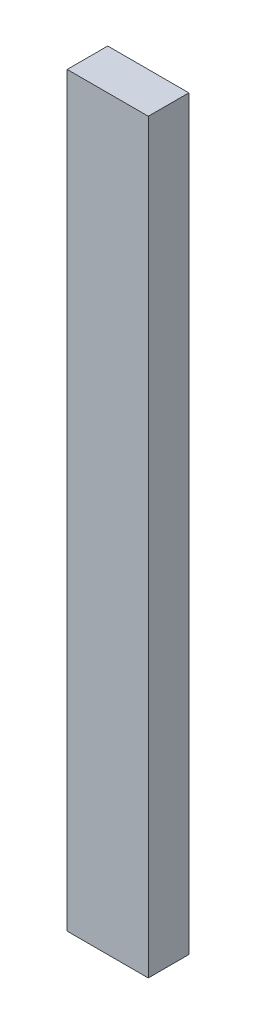
ISO-10303-21;
HEADER;
FILE_DESCRIPTION(('STEP AP214'),'2;1');
FILE_NAME('part.step','',(''),(''),'','','');
FILE_SCHEMA(('AUTOMOTIVE_DESIGN { 1 0 10303 214 1 1 1 1 }'));
ENDSEC;
DATA;
#1=APPLICATION_CONTEXT('core data for automotive mechanical design processes');
#2=APPLICATION_PROTOCOL_DEFINITION('international standard','automotive_design',2000,#1);
#3=PRODUCT_CONTEXT('',#1,'mechanical');
#4=PRODUCT('Part','Part','',(#3));
#5=PRODUCT_RELATED_PRODUCT_CATEGORY('part','',(#4));
#6=PRODUCT_DEFINITION_FORMATION('','',#4);
#7=PRODUCT_DEFINITION_CONTEXT('part definition',#1,'design');
#8=PRODUCT_DEFINITION('design','',#6,#7);
#9=PRODUCT_DEFINITION_SHAPE('','',#8);
#10=(LENGTH_UNIT() NAMED_UNIT(*) SI_UNIT(.MILLI.,.METRE.));
#11=(NAMED_UNIT(*) PLANE_ANGLE_UNIT() SI_UNIT($,.RADIAN.));
#12=(NAMED_UNIT(*) SI_UNIT($,.STERADIAN.) SOLID_ANGLE_UNIT());
#13=UNCERTAINTY_MEASURE_WITH_UNIT(LENGTH_MEASURE(1.E-05),#10,'distance_accuracy_value','');
#14=(GEOMETRIC_REPRESENTATION_CONTEXT(3) GLOBAL_UNCERTAINTY_ASSIGNED_CONTEXT((#13)) GLOBAL_UNIT_ASSIGNED_CONTEXT((#10,
#11,#12)) REPRESENTATION_CONTEXT('',''));
#15=CARTESIAN_POINT('',(0.,0.,0.));
#16=DIRECTION('',(0.,0.,1.));
#17=DIRECTION('',(1.,0.,0.));
#18=AXIS2_PLACEMENT_3D('',#15,#16,#17);
#19=CARTESIAN_POINT('',(0.25,4.6,-0.125));
#20=DIRECTION('',(-1.,0.,0.));
#21=DIRECTION('',(0.,0.,1.));
#22=AXIS2_PLACEMENT_3D('',#19,#20,#21);
#23=PLANE('',#22);
#24=DIRECTION('',(0.,0.,-1.));
#25=VECTOR('',#24,1.);
#26=CARTESIAN_POINT('',(0.25,0.,-0.125));
#27=LINE('',#26,#25);
#28=CARTESIAN_POINT('',(0.25,0.,0.125));
#29=VERTEX_POINT('',#28);
#30=CARTESIAN_POINT('',(0.25,0.,-0.125));
#31=VERTEX_POINT('',#30);
#32=EDGE_CURVE('E113',#29,#31,#27,.T.);
#33=ORIENTED_EDGE('',*,*,#32,.T.);
#34=DIRECTION('',(0.,-1.,0.));
#35=VECTOR('',#34,1.);
#36=CARTESIAN_POINT('',(0.25,4.6,-0.125));
#37=LINE('',#36,#35);
#38=CARTESIAN_POINT('',(0.25,4.6,-0.125));
#39=VERTEX_POINT('',#38);
#40=EDGE_CURVE('E11',#39,#31,#37,.T.);
#41=ORIENTED_EDGE('',*,*,#40,.F.);
#42=DIRECTION('',(0.,0.,-1.));
#43=VECTOR('',#42,1.);
#44=CARTESIAN_POINT('',(0.25,4.6,-0.125));
#45=LINE('',#44,#43);
#46=CARTESIAN_POINT('',(0.25,4.6,0.125));
#47=VERTEX_POINT('',#46);
#48=EDGE_CURVE('E95',#47,#39,#45,.T.);
#49=ORIENTED_EDGE('',*,*,#48,.F.);
#50=DIRECTION('',(0.,-1.,0.));
#51=VECTOR('',#50,1.);
#52=CARTESIAN_POINT('',(0.25,4.6,0.125));
#53=LINE('',#52,#51);
#54=EDGE_CURVE('E109',#47,#29,#53,.T.);
#55=ORIENTED_EDGE('',*,*,#54,.T.);
#56=EDGE_LOOP('',(#33,#41,#49,#55));
#57=FACE_BOUND('',#56,.T.);
#58=ADVANCED_FACE('F43',(#57),#23,.F.);
#59=CARTESIAN_POINT('',(-0.25,4.6,-0.125));
#60=DIRECTION('',(0.,0.,1.));
#61=DIRECTION('',(1.,0.,0.));
#62=AXIS2_PLACEMENT_3D('',#59,#60,#61);
#63=PLANE('',#62);
#64=DIRECTION('',(-1.,0.,0.));
#65=VECTOR('',#64,1.);
#66=CARTESIAN_POINT('',(-0.25,0.,-0.125));
#67=LINE('',#66,#65);
#68=CARTESIAN_POINT('',(-0.25,0.,-0.125));
#69=VERTEX_POINT('',#68);
#70=EDGE_CURVE('E100',#31,#69,#67,.T.);
#71=ORIENTED_EDGE('',*,*,#70,.T.);
#72=DIRECTION('',(0.,-1.,0.));
#73=VECTOR('',#72,1.);
#74=CARTESIAN_POINT('',(-0.25,4.6,-0.125));
#75=LINE('',#74,#73);
#76=CARTESIAN_POINT('',(-0.25,4.6,-0.125));
#77=VERTEX_POINT('',#76);
#78=EDGE_CURVE('E52',#77,#69,#75,.T.);
#79=ORIENTED_EDGE('',*,*,#78,.F.);
#80=DIRECTION('',(-1.,0.,0.));
#81=VECTOR('',#80,1.);
#82=CARTESIAN_POINT('',(-0.25,4.6,-0.125));
#83=LINE('',#82,#81);
#84=EDGE_CURVE('E90',#39,#77,#83,.T.);
#85=ORIENTED_EDGE('',*,*,#84,.F.);
#86=ORIENTED_EDGE('',*,*,#40,.T.);
#87=EDGE_LOOP('',(#71,#79,#85,#86));
#88=FACE_BOUND('',#87,.T.);
#89=ADVANCED_FACE('F99',(#88),#63,.F.);
#90=CARTESIAN_POINT('',(-0.25,4.6,-0.125));
#91=DIRECTION('',(1.,0.,0.));
#92=DIRECTION('',(0.,0.,-1.));
#93=AXIS2_PLACEMENT_3D('',#90,#91,#92);
#94=PLANE('',#93);
#95=DIRECTION('',(0.,0.,1.));
#96=VECTOR('',#95,1.);
#97=CARTESIAN_POINT('',(-0.25,0.,-0.125));
#98=LINE('',#97,#96);
#99=CARTESIAN_POINT('',(-0.25,0.,0.125));
#100=VERTEX_POINT('',#99);
#101=EDGE_CURVE('E77',#69,#100,#98,.T.);
#102=ORIENTED_EDGE('',*,*,#101,.T.);
#103=DIRECTION('',(0.,-1.,0.));
#104=VECTOR('',#103,1.);
#105=CARTESIAN_POINT('',(-0.25,4.6,0.125));
#106=LINE('',#105,#104);
#107=CARTESIAN_POINT('',(-0.25,4.6,0.125));
#108=VERTEX_POINT('',#107);
#109=EDGE_CURVE('E102',#108,#100,#106,.T.);
#110=ORIENTED_EDGE('',*,*,#109,.F.);
#111=DIRECTION('',(0.,0.,1.));
#112=VECTOR('',#111,1.);
#113=CARTESIAN_POINT('',(-0.25,4.6,-0.125));
#114=LINE('',#113,#112);
#115=EDGE_CURVE('E93',#77,#108,#114,.T.);
#116=ORIENTED_EDGE('',*,*,#115,.F.);
#117=ORIENTED_EDGE('',*,*,#78,.T.);
#118=EDGE_LOOP('',(#102,#110,#116,#117));
#119=FACE_BOUND('',#118,.T.);
#120=ADVANCED_FACE('F103',(#119),#94,.F.);
#121=CARTESIAN_POINT('',(-0.25,4.6,0.125));
#122=DIRECTION('',(0.,0.,-1.));
#123=DIRECTION('',(-1.,0.,0.));
#124=AXIS2_PLACEMENT_3D('',#121,#122,#123);
#125=PLANE('',#124);
#126=DIRECTION('',(1.,0.,0.));
#127=VECTOR('',#126,1.);
#128=CARTESIAN_POINT('',(-0.25,0.,0.125));
#129=LINE('',#128,#127);
#130=EDGE_CURVE('E83',#100,#29,#129,.T.);
#131=ORIENTED_EDGE('',*,*,#130,.T.);
#132=ORIENTED_EDGE('',*,*,#54,.F.);
#133=DIRECTION('',(1.,0.,0.));
#134=VECTOR('',#133,1.);
#135=CARTESIAN_POINT('',(-0.25,4.6,0.125));
#136=LINE('',#135,#134);
#137=EDGE_CURVE('E60',#108,#47,#136,.T.);
#138=ORIENTED_EDGE('',*,*,#137,.F.);
#139=ORIENTED_EDGE('',*,*,#109,.T.);
#140=EDGE_LOOP('',(#131,#132,#138,#139));
#141=FACE_BOUND('',#140,.T.);
#142=ADVANCED_FACE('F126',(#141),#125,.F.);
#143=CARTESIAN_POINT('',(0.,4.6,0.));
#144=DIRECTION('',(0.,1.,0.));
#145=DIRECTION('',(0.,0.,1.));
#146=AXIS2_PLACEMENT_3D('',#143,#144,#145);
#147=PLANE('',#146);
#148=ORIENTED_EDGE('',*,*,#48,.T.);
#149=ORIENTED_EDGE('',*,*,#84,.T.);
#150=ORIENTED_EDGE('',*,*,#115,.T.);
#151=ORIENTED_EDGE('',*,*,#137,.T.);
#152=EDGE_LOOP('',(#148,#149,#150,#151));
#153=FACE_BOUND('',#152,.T.);
#154=ADVANCED_FACE('F91',(#153),#147,.T.);
#155=CARTESIAN_POINT('',(0.,0.,0.));
#156=DIRECTION('',(0.,1.,0.));
#157=DIRECTION('',(0.,0.,1.));
#158=AXIS2_PLACEMENT_3D('',#155,#156,#157);
#159=PLANE('',#158);
#160=ORIENTED_EDGE('',*,*,#32,.F.);
#161=ORIENTED_EDGE('',*,*,#130,.F.);
#162=ORIENTED_EDGE('',*,*,#101,.F.);
#163=ORIENTED_EDGE('',*,*,#70,.F.);
#164=EDGE_LOOP('',(#160,#161,#162,#163));
#165=FACE_BOUND('',#164,.T.);
#166=ADVANCED_FACE('F129',(#165),#159,.F.);
#167=CLOSED_SHELL('',(#58,#89,#120,#142,#154,#166));
#168=MANIFOLD_SOLID_BREP('B2',#167);
#169=ADVANCED_BREP_SHAPE_REPRESENTATION('',(#18,#168),#14);
#170=SHAPE_DEFINITION_REPRESENTATION(#9,#169);
ENDSEC;
END-ISO-10303-21;
